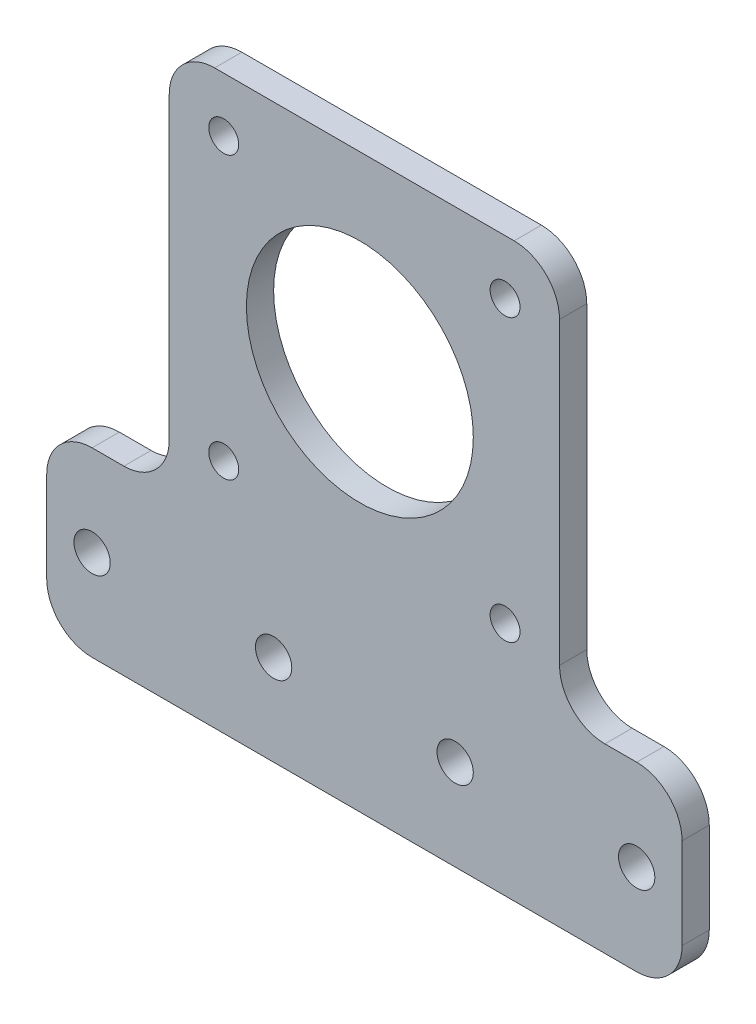
ISO-10303-21;
HEADER;
FILE_DESCRIPTION(('STEP AP214'),'2;1');
FILE_NAME('part.step','',(''),(''),'','','');
FILE_SCHEMA(('AUTOMOTIVE_DESIGN { 1 0 10303 214 1 1 1 1 }'));
ENDSEC;
DATA;
#1=APPLICATION_CONTEXT('core data for automotive mechanical design processes');
#2=APPLICATION_PROTOCOL_DEFINITION('international standard','automotive_design',2000,#1);
#3=PRODUCT_CONTEXT('',#1,'mechanical');
#4=PRODUCT('Part','Part','',(#3));
#5=PRODUCT_RELATED_PRODUCT_CATEGORY('part','',(#4));
#6=PRODUCT_DEFINITION_FORMATION('','',#4);
#7=PRODUCT_DEFINITION_CONTEXT('part definition',#1,'design');
#8=PRODUCT_DEFINITION('design','',#6,#7);
#9=PRODUCT_DEFINITION_SHAPE('','',#8);
#10=(LENGTH_UNIT() NAMED_UNIT(*) SI_UNIT(.MILLI.,.METRE.));
#11=(NAMED_UNIT(*) PLANE_ANGLE_UNIT() SI_UNIT($,.RADIAN.));
#12=(NAMED_UNIT(*) SI_UNIT($,.STERADIAN.) SOLID_ANGLE_UNIT());
#13=UNCERTAINTY_MEASURE_WITH_UNIT(LENGTH_MEASURE(1.E-05),#10,'distance_accuracy_value','');
#14=(GEOMETRIC_REPRESENTATION_CONTEXT(3) GLOBAL_UNCERTAINTY_ASSIGNED_CONTEXT((#13)) GLOBAL_UNIT_ASSIGNED_CONTEXT((#10,
#11,#12)) REPRESENTATION_CONTEXT('',''));
#15=CARTESIAN_POINT('',(0.,0.,0.));
#16=DIRECTION('',(0.,0.,1.));
#17=DIRECTION('',(1.,0.,0.));
#18=AXIS2_PLACEMENT_3D('',#15,#16,#17);
#19=CARTESIAN_POINT('',(56.5,0.,3.));
#20=DIRECTION('',(1.,0.,0.));
#21=DIRECTION('',(0.,1.,0.));
#22=AXIS2_PLACEMENT_3D('',#19,#20,#21);
#23=PLANE('',#22);
#24=DIRECTION('',(0.,-1.,0.));
#25=VECTOR('',#24,1.);
#26=CARTESIAN_POINT('',(56.5,0.,3.));
#27=LINE('',#26,#25);
#28=CARTESIAN_POINT('',(56.5,58.,3.));
#29=VERTEX_POINT('',#28);
#30=CARTESIAN_POINT('',(56.5,25.,3.));
#31=VERTEX_POINT('',#30);
#32=EDGE_CURVE('E318',#29,#31,#27,.T.);
#33=ORIENTED_EDGE('',*,*,#32,.T.);
#34=DIRECTION('',(0.,0.,-1.));
#35=VECTOR('',#34,1.);
#36=CARTESIAN_POINT('',(56.5,25.,0.));
#37=LINE('',#36,#35);
#38=CARTESIAN_POINT('',(56.5,25.,0.));
#39=VERTEX_POINT('',#38);
#40=EDGE_CURVE('E172',#31,#39,#37,.T.);
#41=ORIENTED_EDGE('',*,*,#40,.T.);
#42=DIRECTION('',(0.,-1.,0.));
#43=VECTOR('',#42,1.);
#44=CARTESIAN_POINT('',(56.5,0.,0.));
#45=LINE('',#44,#43);
#46=CARTESIAN_POINT('',(56.5,58.,0.));
#47=VERTEX_POINT('',#46);
#48=EDGE_CURVE('E156',#47,#39,#45,.T.);
#49=ORIENTED_EDGE('',*,*,#48,.F.);
#50=DIRECTION('',(0.,0.,-1.));
#51=VECTOR('',#50,1.);
#52=CARTESIAN_POINT('',(56.5,58.,3.));
#53=LINE('',#52,#51);
#54=EDGE_CURVE('E169',#47,#29,#53,.F.);
#55=ORIENTED_EDGE('',*,*,#54,.T.);
#56=EDGE_LOOP('',(#33,#41,#49,#55));
#57=FACE_BOUND('',#56,.T.);
#58=ADVANCED_FACE('F37',(#57),#23,.T.);
#59=CARTESIAN_POINT('',(0.,63.,3.));
#60=DIRECTION('',(0.,1.,0.));
#61=DIRECTION('',(0.,0.,1.));
#62=AXIS2_PLACEMENT_3D('',#59,#60,#61);
#63=PLANE('',#62);
#64=DIRECTION('',(1.,0.,0.));
#65=VECTOR('',#64,1.);
#66=CARTESIAN_POINT('',(0.,63.,3.));
#67=LINE('',#66,#65);
#68=CARTESIAN_POINT('',(18.5,63.,3.));
#69=VERTEX_POINT('',#68);
#70=CARTESIAN_POINT('',(51.5,63.,3.));
#71=VERTEX_POINT('',#70);
#72=EDGE_CURVE('E276',#69,#71,#67,.T.);
#73=ORIENTED_EDGE('',*,*,#72,.T.);
#74=DIRECTION('',(0.,0.,-1.));
#75=VECTOR('',#74,1.);
#76=CARTESIAN_POINT('',(51.5,63.,3.));
#77=LINE('',#76,#75);
#78=CARTESIAN_POINT('',(51.5,63.,0.));
#79=VERTEX_POINT('',#78);
#80=EDGE_CURVE('E237',#71,#79,#77,.T.);
#81=ORIENTED_EDGE('',*,*,#80,.T.);
#82=DIRECTION('',(1.,0.,0.));
#83=VECTOR('',#82,1.);
#84=CARTESIAN_POINT('',(0.,63.,0.));
#85=LINE('',#84,#83);
#86=CARTESIAN_POINT('',(18.5,63.,0.));
#87=VERTEX_POINT('',#86);
#88=EDGE_CURVE('E158',#87,#79,#85,.T.);
#89=ORIENTED_EDGE('',*,*,#88,.F.);
#90=DIRECTION('',(0.,0.,-1.));
#91=VECTOR('',#90,1.);
#92=CARTESIAN_POINT('',(18.5,63.,3.));
#93=LINE('',#92,#91);
#94=EDGE_CURVE('E235',#87,#69,#93,.F.);
#95=ORIENTED_EDGE('',*,*,#94,.T.);
#96=EDGE_LOOP('',(#73,#81,#89,#95));
#97=FACE_BOUND('',#96,.T.);
#98=ADVANCED_FACE('F399',(#97),#63,.T.);
#99=CARTESIAN_POINT('',(13.5,0.,3.));
#100=DIRECTION('',(1.,0.,0.));
#101=DIRECTION('',(0.,1.,0.));
#102=AXIS2_PLACEMENT_3D('',#99,#100,#101);
#103=PLANE('',#102);
#104=DIRECTION('',(0.,-1.,0.));
#105=VECTOR('',#104,1.);
#106=CARTESIAN_POINT('',(13.5,0.,0.));
#107=LINE('',#106,#105);
#108=CARTESIAN_POINT('',(13.5,58.,0.));
#109=VERTEX_POINT('',#108);
#110=CARTESIAN_POINT('',(13.5,25.,0.));
#111=VERTEX_POINT('',#110);
#112=EDGE_CURVE('E245',#109,#111,#107,.T.);
#113=ORIENTED_EDGE('',*,*,#112,.T.);
#114=DIRECTION('',(0.,0.,-1.));
#115=VECTOR('',#114,1.);
#116=CARTESIAN_POINT('',(13.5,25.,3.));
#117=LINE('',#116,#115);
#118=CARTESIAN_POINT('',(13.5,25.,3.));
#119=VERTEX_POINT('',#118);
#120=EDGE_CURVE('E233',#111,#119,#117,.F.);
#121=ORIENTED_EDGE('',*,*,#120,.T.);
#122=DIRECTION('',(0.,-1.,0.));
#123=VECTOR('',#122,1.);
#124=CARTESIAN_POINT('',(13.5,0.,3.));
#125=LINE('',#124,#123);
#126=CARTESIAN_POINT('',(13.5,58.,3.));
#127=VERTEX_POINT('',#126);
#128=EDGE_CURVE('E266',#127,#119,#125,.T.);
#129=ORIENTED_EDGE('',*,*,#128,.F.);
#130=DIRECTION('',(0.,0.,-1.));
#131=VECTOR('',#130,1.);
#132=CARTESIAN_POINT('',(13.5,58.,0.));
#133=LINE('',#132,#131);
#134=EDGE_CURVE('E230',#127,#109,#133,.T.);
#135=ORIENTED_EDGE('',*,*,#134,.T.);
#136=EDGE_LOOP('',(#113,#121,#129,#135));
#137=FACE_BOUND('',#136,.T.);
#138=ADVANCED_FACE('F252',(#137),#103,.F.);
#139=CARTESIAN_POINT('',(0.,20.,3.));
#140=DIRECTION('',(0.,1.,0.));
#141=DIRECTION('',(0.,0.,1.));
#142=AXIS2_PLACEMENT_3D('',#139,#140,#141);
#143=PLANE('',#142);
#144=DIRECTION('',(1.,0.,0.));
#145=VECTOR('',#144,1.);
#146=CARTESIAN_POINT('',(0.,20.,0.));
#147=LINE('',#146,#145);
#148=CARTESIAN_POINT('',(5.,20.,0.));
#149=VERTEX_POINT('',#148);
#150=CARTESIAN_POINT('',(8.5,20.,0.));
#151=VERTEX_POINT('',#150);
#152=EDGE_CURVE('E247',#149,#151,#147,.T.);
#153=ORIENTED_EDGE('',*,*,#152,.F.);
#154=DIRECTION('',(0.,0.,-1.));
#155=VECTOR('',#154,1.);
#156=CARTESIAN_POINT('',(5.,20.,3.));
#157=LINE('',#156,#155);
#158=CARTESIAN_POINT('',(5.,20.,3.));
#159=VERTEX_POINT('',#158);
#160=EDGE_CURVE('E228',#149,#159,#157,.F.);
#161=ORIENTED_EDGE('',*,*,#160,.T.);
#162=DIRECTION('',(1.,0.,0.));
#163=VECTOR('',#162,1.);
#164=CARTESIAN_POINT('',(0.,20.,3.));
#165=LINE('',#164,#163);
#166=CARTESIAN_POINT('',(8.5,20.,3.));
#167=VERTEX_POINT('',#166);
#168=EDGE_CURVE('E264',#159,#167,#165,.T.);
#169=ORIENTED_EDGE('',*,*,#168,.T.);
#170=DIRECTION('',(0.,0.,-1.));
#171=VECTOR('',#170,1.);
#172=CARTESIAN_POINT('',(8.5,20.,3.));
#173=LINE('',#172,#171);
#174=EDGE_CURVE('E225',#167,#151,#173,.T.);
#175=ORIENTED_EDGE('',*,*,#174,.T.);
#176=EDGE_LOOP('',(#153,#161,#169,#175));
#177=FACE_BOUND('',#176,.T.);
#178=ADVANCED_FACE('F268',(#177),#143,.T.);
#179=CARTESIAN_POINT('',(0.,0.,3.));
#180=DIRECTION('',(-1.,0.,0.));
#181=DIRECTION('',(0.,0.,1.));
#182=AXIS2_PLACEMENT_3D('',#179,#180,#181);
#183=PLANE('',#182);
#184=DIRECTION('',(0.,1.,0.));
#185=VECTOR('',#184,1.);
#186=CARTESIAN_POINT('',(0.,0.,0.));
#187=LINE('',#186,#185);
#188=CARTESIAN_POINT('',(0.,5.,0.));
#189=VERTEX_POINT('',#188);
#190=CARTESIAN_POINT('',(0.,15.,0.));
#191=VERTEX_POINT('',#190);
#192=EDGE_CURVE('E298',#189,#191,#187,.T.);
#193=ORIENTED_EDGE('',*,*,#192,.F.);
#194=DIRECTION('',(0.,0.,-1.));
#195=VECTOR('',#194,1.);
#196=CARTESIAN_POINT('',(0.,5.,3.));
#197=LINE('',#196,#195);
#198=CARTESIAN_POINT('',(0.,5.,3.));
#199=VERTEX_POINT('',#198);
#200=EDGE_CURVE('E223',#189,#199,#197,.F.);
#201=ORIENTED_EDGE('',*,*,#200,.T.);
#202=DIRECTION('',(0.,1.,0.));
#203=VECTOR('',#202,1.);
#204=CARTESIAN_POINT('',(0.,0.,3.));
#205=LINE('',#204,#203);
#206=CARTESIAN_POINT('',(0.,15.,3.));
#207=VERTEX_POINT('',#206);
#208=EDGE_CURVE('E270',#199,#207,#205,.T.);
#209=ORIENTED_EDGE('',*,*,#208,.T.);
#210=DIRECTION('',(0.,0.,-1.));
#211=VECTOR('',#210,1.);
#212=CARTESIAN_POINT('',(0.,15.,3.));
#213=LINE('',#212,#211);
#214=EDGE_CURVE('E220',#207,#191,#213,.T.);
#215=ORIENTED_EDGE('',*,*,#214,.T.);
#216=EDGE_LOOP('',(#193,#201,#209,#215));
#217=FACE_BOUND('',#216,.T.);
#218=ADVANCED_FACE('F535',(#217),#183,.T.);
#219=CARTESIAN_POINT('',(0.,0.,3.));
#220=DIRECTION('',(0.,1.,0.));
#221=DIRECTION('',(0.,0.,1.));
#222=AXIS2_PLACEMENT_3D('',#219,#220,#221);
#223=PLANE('',#222);
#224=DIRECTION('',(1.,0.,0.));
#225=VECTOR('',#224,1.);
#226=CARTESIAN_POINT('',(0.,0.,0.));
#227=LINE('',#226,#225);
#228=CARTESIAN_POINT('',(5.,0.,0.));
#229=VERTEX_POINT('',#228);
#230=CARTESIAN_POINT('',(65.,0.,0.));
#231=VERTEX_POINT('',#230);
#232=EDGE_CURVE('E302',#229,#231,#227,.T.);
#233=ORIENTED_EDGE('',*,*,#232,.T.);
#234=DIRECTION('',(0.,0.,-1.));
#235=VECTOR('',#234,1.);
#236=CARTESIAN_POINT('',(65.,0.,3.));
#237=LINE('',#236,#235);
#238=CARTESIAN_POINT('',(65.,0.,3.));
#239=VERTEX_POINT('',#238);
#240=EDGE_CURVE('E52',#231,#239,#237,.F.);
#241=ORIENTED_EDGE('',*,*,#240,.T.);
#242=DIRECTION('',(1.,0.,0.));
#243=VECTOR('',#242,1.);
#244=CARTESIAN_POINT('',(0.,0.,3.));
#245=LINE('',#244,#243);
#246=CARTESIAN_POINT('',(5.,0.,3.));
#247=VERTEX_POINT('',#246);
#248=EDGE_CURVE('E274',#247,#239,#245,.T.);
#249=ORIENTED_EDGE('',*,*,#248,.F.);
#250=DIRECTION('',(0.,0.,-1.));
#251=VECTOR('',#250,1.);
#252=CARTESIAN_POINT('',(5.,0.,0.));
#253=LINE('',#252,#251);
#254=EDGE_CURVE('E216',#247,#229,#253,.T.);
#255=ORIENTED_EDGE('',*,*,#254,.T.);
#256=EDGE_LOOP('',(#233,#241,#249,#255));
#257=FACE_BOUND('',#256,.T.);
#258=ADVANCED_FACE('F527',(#257),#223,.F.);
#259=CARTESIAN_POINT('',(70.,0.,3.));
#260=DIRECTION('',(-1.,0.,0.));
#261=DIRECTION('',(0.,0.,1.));
#262=AXIS2_PLACEMENT_3D('',#259,#260,#261);
#263=PLANE('',#262);
#264=DIRECTION('',(0.,1.,0.));
#265=VECTOR('',#264,1.);
#266=CARTESIAN_POINT('',(70.,0.,0.));
#267=LINE('',#266,#265);
#268=CARTESIAN_POINT('',(70.,5.,0.));
#269=VERTEX_POINT('',#268);
#270=CARTESIAN_POINT('',(70.,15.,0.));
#271=VERTEX_POINT('',#270);
#272=EDGE_CURVE('E304',#269,#271,#267,.T.);
#273=ORIENTED_EDGE('',*,*,#272,.T.);
#274=DIRECTION('',(0.,0.,-1.));
#275=VECTOR('',#274,1.);
#276=CARTESIAN_POINT('',(70.,15.,3.));
#277=LINE('',#276,#275);
#278=CARTESIAN_POINT('',(70.,15.,3.));
#279=VERTEX_POINT('',#278);
#280=EDGE_CURVE('E204',#271,#279,#277,.F.);
#281=ORIENTED_EDGE('',*,*,#280,.T.);
#282=DIRECTION('',(0.,1.,0.));
#283=VECTOR('',#282,1.);
#284=CARTESIAN_POINT('',(70.,0.,3.));
#285=LINE('',#284,#283);
#286=CARTESIAN_POINT('',(70.,5.,3.));
#287=VERTEX_POINT('',#286);
#288=EDGE_CURVE('E279',#287,#279,#285,.T.);
#289=ORIENTED_EDGE('',*,*,#288,.F.);
#290=DIRECTION('',(0.,0.,-1.));
#291=VECTOR('',#290,1.);
#292=CARTESIAN_POINT('',(70.,5.,3.));
#293=LINE('',#292,#291);
#294=EDGE_CURVE('E201',#287,#269,#293,.T.);
#295=ORIENTED_EDGE('',*,*,#294,.T.);
#296=EDGE_LOOP('',(#273,#281,#289,#295));
#297=FACE_BOUND('',#296,.T.);
#298=ADVANCED_FACE('F520',(#297),#263,.F.);
#299=CARTESIAN_POINT('',(50.5,26.,3.));
#300=DIRECTION('',(0.,0.,-1.));
#301=DIRECTION('',(-1.,0.,0.));
#302=AXIS2_PLACEMENT_3D('',#299,#300,#301);
#303=CYLINDRICAL_SURFACE('',#302,1.65);
#304=CARTESIAN_POINT('',(50.5,26.,3.));
#305=DIRECTION('',(0.,0.,1.));
#306=DIRECTION('',(1.,0.,0.));
#307=AXIS2_PLACEMENT_3D('',#304,#305,#306);
#308=CIRCLE('',#307,1.65);
#309=CARTESIAN_POINT('',(52.15,26.,3.));
#310=VERTEX_POINT('',#309);
#311=EDGE_CURVE('E183',#310,#310,#308,.T.);
#312=ORIENTED_EDGE('',*,*,#311,.T.);
#313=EDGE_LOOP('',(#312));
#314=FACE_BOUND('',#313,.T.);
#315=CARTESIAN_POINT('',(50.5,26.,0.));
#316=DIRECTION('',(0.,0.,1.));
#317=DIRECTION('',(1.,0.,0.));
#318=AXIS2_PLACEMENT_3D('',#315,#316,#317);
#319=CIRCLE('',#318,1.65);
#320=CARTESIAN_POINT('',(52.15,26.,0.));
#321=VERTEX_POINT('',#320);
#322=EDGE_CURVE('E306',#321,#321,#319,.T.);
#323=ORIENTED_EDGE('',*,*,#322,.F.);
#324=EDGE_LOOP('',(#323));
#325=FACE_BOUND('',#324,.T.);
#326=ADVANCED_FACE('F512',(#314,#325),#303,.F.);
#327=CARTESIAN_POINT('',(61.5,20.,0.));
#328=VERTEX_POINT('',#327);
#329=CARTESIAN_POINT('',(65.,20.,0.));
#330=VERTEX_POINT('',#329);
#331=EDGE_CURVE('E299',#328,#330,#147,.T.);
#332=ORIENTED_EDGE('',*,*,#331,.F.);
#333=DIRECTION('',(0.,0.,-1.));
#334=VECTOR('',#333,1.);
#335=CARTESIAN_POINT('',(61.5,20.,3.));
#336=LINE('',#335,#334);
#337=CARTESIAN_POINT('',(61.5,20.,3.));
#338=VERTEX_POINT('',#337);
#339=EDGE_CURVE('E191',#328,#338,#336,.F.);
#340=ORIENTED_EDGE('',*,*,#339,.T.);
#341=CARTESIAN_POINT('',(65.,20.,3.));
#342=VERTEX_POINT('',#341);
#343=EDGE_CURVE('E272',#338,#342,#165,.T.);
#344=ORIENTED_EDGE('',*,*,#343,.T.);
#345=DIRECTION('',(0.,0.,-1.));
#346=VECTOR('',#345,1.);
#347=CARTESIAN_POINT('',(65.,20.,0.));
#348=LINE('',#347,#346);
#349=EDGE_CURVE('E180',#342,#330,#348,.T.);
#350=ORIENTED_EDGE('',*,*,#349,.T.);
#351=EDGE_LOOP('',(#332,#340,#344,#350));
#352=FACE_BOUND('',#351,.T.);
#353=ADVANCED_FACE('F314',(#352),#143,.T.);
#354=CARTESIAN_POINT('',(19.5,57.,3.));
#355=DIRECTION('',(0.,0.,-1.));
#356=DIRECTION('',(-1.,0.,0.));
#357=AXIS2_PLACEMENT_3D('',#354,#355,#356);
#358=CYLINDRICAL_SURFACE('',#357,1.65);
#359=CARTESIAN_POINT('',(19.5,57.,3.));
#360=DIRECTION('',(0.,0.,1.));
#361=DIRECTION('',(1.,0.,0.));
#362=AXIS2_PLACEMENT_3D('',#359,#360,#361);
#363=CIRCLE('',#362,1.65);
#364=CARTESIAN_POINT('',(21.15,57.,3.));
#365=VERTEX_POINT('',#364);
#366=EDGE_CURVE('E319',#365,#365,#363,.T.);
#367=ORIENTED_EDGE('',*,*,#366,.T.);
#368=EDGE_LOOP('',(#367));
#369=FACE_BOUND('',#368,.T.);
#370=CARTESIAN_POINT('',(19.5,57.,0.));
#371=DIRECTION('',(0.,0.,1.));
#372=DIRECTION('',(1.,0.,0.));
#373=AXIS2_PLACEMENT_3D('',#370,#371,#372);
#374=CIRCLE('',#373,1.65);
#375=CARTESIAN_POINT('',(21.15,57.,0.));
#376=VERTEX_POINT('',#375);
#377=EDGE_CURVE('E173',#376,#376,#374,.T.);
#378=ORIENTED_EDGE('',*,*,#377,.F.);
#379=EDGE_LOOP('',(#378));
#380=FACE_BOUND('',#379,.T.);
#381=ADVANCED_FACE('F383',(#369,#380),#358,.F.);
#382=CARTESIAN_POINT('',(50.5,57.,3.));
#383=DIRECTION('',(0.,0.,-1.));
#384=DIRECTION('',(-1.,0.,0.));
#385=AXIS2_PLACEMENT_3D('',#382,#383,#384);
#386=CYLINDRICAL_SURFACE('',#385,1.65);
#387=CARTESIAN_POINT('',(50.5,57.,3.));
#388=DIRECTION('',(0.,0.,1.));
#389=DIRECTION('',(1.,0.,0.));
#390=AXIS2_PLACEMENT_3D('',#387,#388,#389);
#391=CIRCLE('',#390,1.65);
#392=CARTESIAN_POINT('',(52.15,57.,3.));
#393=VERTEX_POINT('',#392);
#394=EDGE_CURVE('E310',#393,#393,#391,.F.);
#395=ORIENTED_EDGE('',*,*,#394,.F.);
#396=EDGE_LOOP('',(#395));
#397=FACE_BOUND('',#396,.T.);
#398=CARTESIAN_POINT('',(50.5,57.,0.));
#399=DIRECTION('',(0.,0.,1.));
#400=DIRECTION('',(1.,0.,0.));
#401=AXIS2_PLACEMENT_3D('',#398,#399,#400);
#402=CIRCLE('',#401,1.65);
#403=CARTESIAN_POINT('',(52.15,57.,0.));
#404=VERTEX_POINT('',#403);
#405=EDGE_CURVE('E290',#404,#404,#402,.F.);
#406=ORIENTED_EDGE('',*,*,#405,.T.);
#407=EDGE_LOOP('',(#406));
#408=FACE_BOUND('',#407,.T.);
#409=ADVANCED_FACE('F386',(#397,#408),#386,.F.);
#410=CARTESIAN_POINT('',(19.5,26.,3.));
#411=DIRECTION('',(0.,0.,-1.));
#412=DIRECTION('',(-1.,0.,0.));
#413=AXIS2_PLACEMENT_3D('',#410,#411,#412);
#414=CYLINDRICAL_SURFACE('',#413,1.65);
#415=CARTESIAN_POINT('',(19.5,26.,3.));
#416=DIRECTION('',(0.,0.,1.));
#417=DIRECTION('',(1.,0.,0.));
#418=AXIS2_PLACEMENT_3D('',#415,#416,#417);
#419=CIRCLE('',#418,1.65);
#420=CARTESIAN_POINT('',(21.15,26.,3.));
#421=VERTEX_POINT('',#420);
#422=EDGE_CURVE('E178',#421,#421,#419,.F.);
#423=ORIENTED_EDGE('',*,*,#422,.F.);
#424=EDGE_LOOP('',(#423));
#425=FACE_BOUND('',#424,.T.);
#426=CARTESIAN_POINT('',(19.5,26.,0.));
#427=DIRECTION('',(0.,0.,1.));
#428=DIRECTION('',(1.,0.,0.));
#429=AXIS2_PLACEMENT_3D('',#426,#427,#428);
#430=CIRCLE('',#429,1.65);
#431=CARTESIAN_POINT('',(21.15,26.,0.));
#432=VERTEX_POINT('',#431);
#433=EDGE_CURVE('E186',#432,#432,#430,.F.);
#434=ORIENTED_EDGE('',*,*,#433,.T.);
#435=EDGE_LOOP('',(#434));
#436=FACE_BOUND('',#435,.T.);
#437=ADVANCED_FACE('F369',(#425,#436),#414,.F.);
#438=CARTESIAN_POINT('',(0.,0.,3.));
#439=DIRECTION('',(0.,0.,1.));
#440=DIRECTION('',(1.,0.,0.));
#441=AXIS2_PLACEMENT_3D('',#438,#439,#440);
#442=PLANE('',#441);
#443=CARTESIAN_POINT('',(34.5,42.,3.));
#444=DIRECTION('',(0.,0.,1.));
#445=DIRECTION('',(1.,0.,0.));
#446=AXIS2_PLACEMENT_3D('',#443,#444,#445);
#447=CIRCLE('',#446,12.5);
#448=CARTESIAN_POINT('',(47.,42.,3.));
#449=VERTEX_POINT('',#448);
#450=EDGE_CURVE('E352',#449,#449,#447,.T.);
#451=ORIENTED_EDGE('',*,*,#450,.F.);
#452=EDGE_LOOP('',(#451));
#453=FACE_BOUND('',#452,.T.);
#454=CARTESIAN_POINT('',(5.,10.,3.));
#455=DIRECTION('',(0.,0.,1.));
#456=DIRECTION('',(1.,0.,0.));
#457=AXIS2_PLACEMENT_3D('',#454,#455,#456);
#458=CIRCLE('',#457,2.);
#459=CARTESIAN_POINT('',(7.,10.,3.));
#460=VERTEX_POINT('',#459);
#461=EDGE_CURVE('E347',#460,#460,#458,.T.);
#462=ORIENTED_EDGE('',*,*,#461,.F.);
#463=EDGE_LOOP('',(#462));
#464=FACE_BOUND('',#463,.T.);
#465=CARTESIAN_POINT('',(25.,10.,3.));
#466=DIRECTION('',(0.,0.,1.));
#467=DIRECTION('',(1.,0.,0.));
#468=AXIS2_PLACEMENT_3D('',#465,#466,#467);
#469=CIRCLE('',#468,2.);
#470=CARTESIAN_POINT('',(27.,10.,3.));
#471=VERTEX_POINT('',#470);
#472=EDGE_CURVE('E341',#471,#471,#469,.T.);
#473=ORIENTED_EDGE('',*,*,#472,.F.);
#474=EDGE_LOOP('',(#473));
#475=FACE_BOUND('',#474,.T.);
#476=CARTESIAN_POINT('',(45.,10.,3.));
#477=DIRECTION('',(0.,0.,1.));
#478=DIRECTION('',(1.,0.,0.));
#479=AXIS2_PLACEMENT_3D('',#476,#477,#478);
#480=CIRCLE('',#479,2.);
#481=CARTESIAN_POINT('',(47.,10.,3.));
#482=VERTEX_POINT('',#481);
#483=EDGE_CURVE('E335',#482,#482,#480,.T.);
#484=ORIENTED_EDGE('',*,*,#483,.F.);
#485=EDGE_LOOP('',(#484));
#486=FACE_BOUND('',#485,.T.);
#487=CARTESIAN_POINT('',(65.,10.,3.));
#488=DIRECTION('',(0.,0.,1.));
#489=DIRECTION('',(1.,0.,0.));
#490=AXIS2_PLACEMENT_3D('',#487,#488,#489);
#491=CIRCLE('',#490,2.);
#492=CARTESIAN_POINT('',(67.,10.,3.));
#493=VERTEX_POINT('',#492);
#494=EDGE_CURVE('E328',#493,#493,#491,.T.);
#495=ORIENTED_EDGE('',*,*,#494,.F.);
#496=EDGE_LOOP('',(#495));
#497=FACE_BOUND('',#496,.T.);
#498=ORIENTED_EDGE('',*,*,#394,.T.);
#499=EDGE_LOOP('',(#498));
#500=FACE_BOUND('',#499,.T.);
#501=ORIENTED_EDGE('',*,*,#366,.F.);
#502=EDGE_LOOP('',(#501));
#503=FACE_BOUND('',#502,.T.);
#504=ORIENTED_EDGE('',*,*,#288,.T.);
#505=CARTESIAN_POINT('',(65.,15.,3.));
#506=DIRECTION('',(0.,0.,1.));
#507=DIRECTION('',(1.,0.,0.));
#508=AXIS2_PLACEMENT_3D('',#505,#506,#507);
#509=CIRCLE('',#508,5.);
#510=EDGE_CURVE('E214',#279,#342,#509,.T.);
#511=ORIENTED_EDGE('',*,*,#510,.T.);
#512=ORIENTED_EDGE('',*,*,#343,.F.);
#513=CARTESIAN_POINT('',(61.5,25.,3.));
#514=DIRECTION('',(0.,0.,1.));
#515=DIRECTION('',(1.,0.,0.));
#516=AXIS2_PLACEMENT_3D('',#513,#514,#515);
#517=CIRCLE('',#516,5.);
#518=EDGE_CURVE('E241',#338,#31,#517,.F.);
#519=ORIENTED_EDGE('',*,*,#518,.T.);
#520=ORIENTED_EDGE('',*,*,#32,.F.);
#521=CARTESIAN_POINT('',(51.5,58.,3.));
#522=DIRECTION('',(0.,0.,1.));
#523=DIRECTION('',(1.,0.,0.));
#524=AXIS2_PLACEMENT_3D('',#521,#522,#523);
#525=CIRCLE('',#524,5.);
#526=EDGE_CURVE('E177',#29,#71,#525,.T.);
#527=ORIENTED_EDGE('',*,*,#526,.T.);
#528=ORIENTED_EDGE('',*,*,#72,.F.);
#529=CARTESIAN_POINT('',(18.5,58.,3.));
#530=DIRECTION('',(0.,0.,1.));
#531=DIRECTION('',(1.,0.,0.));
#532=AXIS2_PLACEMENT_3D('',#529,#530,#531);
#533=CIRCLE('',#532,5.);
#534=EDGE_CURVE('E206',#69,#127,#533,.T.);
#535=ORIENTED_EDGE('',*,*,#534,.T.);
#536=ORIENTED_EDGE('',*,*,#128,.T.);
#537=CARTESIAN_POINT('',(8.5,25.,3.));
#538=DIRECTION('',(0.,0.,1.));
#539=DIRECTION('',(1.,0.,0.));
#540=AXIS2_PLACEMENT_3D('',#537,#538,#539);
#541=CIRCLE('',#540,5.);
#542=EDGE_CURVE('E11',#119,#167,#541,.F.);
#543=ORIENTED_EDGE('',*,*,#542,.T.);
#544=ORIENTED_EDGE('',*,*,#168,.F.);
#545=CARTESIAN_POINT('',(5.,15.,3.));
#546=DIRECTION('',(0.,0.,1.));
#547=DIRECTION('',(1.,0.,0.));
#548=AXIS2_PLACEMENT_3D('',#545,#546,#547);
#549=CIRCLE('',#548,5.);
#550=EDGE_CURVE('E209',#159,#207,#549,.T.);
#551=ORIENTED_EDGE('',*,*,#550,.T.);
#552=ORIENTED_EDGE('',*,*,#208,.F.);
#553=CARTESIAN_POINT('',(5.,5.,3.));
#554=DIRECTION('',(0.,0.,1.));
#555=DIRECTION('',(1.,0.,0.));
#556=AXIS2_PLACEMENT_3D('',#553,#554,#555);
#557=CIRCLE('',#556,5.);
#558=EDGE_CURVE('E59',#199,#247,#557,.T.);
#559=ORIENTED_EDGE('',*,*,#558,.T.);
#560=ORIENTED_EDGE('',*,*,#248,.T.);
#561=CARTESIAN_POINT('',(65.,5.,3.));
#562=DIRECTION('',(0.,0.,1.));
#563=DIRECTION('',(1.,0.,0.));
#564=AXIS2_PLACEMENT_3D('',#561,#562,#563);
#565=CIRCLE('',#564,5.);
#566=EDGE_CURVE('E212',#239,#287,#565,.T.);
#567=ORIENTED_EDGE('',*,*,#566,.T.);
#568=EDGE_LOOP('',(#504,#511,#512,#519,#520,#527,#528,#535,#536,#543,#544,#551,#552,#559,#560,#567));
#569=FACE_BOUND('',#568,.T.);
#570=ORIENTED_EDGE('',*,*,#311,.F.);
#571=EDGE_LOOP('',(#570));
#572=FACE_BOUND('',#571,.T.);
#573=ORIENTED_EDGE('',*,*,#422,.T.);
#574=EDGE_LOOP('',(#573));
#575=FACE_BOUND('',#574,.T.);
#576=ADVANCED_FACE('F262',(#453,#464,#475,#486,#497,#500,#503,#569,#572,#575),#442,.T.);
#577=CARTESIAN_POINT('',(0.,0.,0.));
#578=DIRECTION('',(0.,0.,1.));
#579=DIRECTION('',(1.,0.,0.));
#580=AXIS2_PLACEMENT_3D('',#577,#578,#579);
#581=PLANE('',#580);
#582=CARTESIAN_POINT('',(34.5,42.,0.));
#583=DIRECTION('',(0.,0.,1.));
#584=DIRECTION('',(1.,0.,0.));
#585=AXIS2_PLACEMENT_3D('',#582,#583,#584);
#586=CIRCLE('',#585,12.5);
#587=CARTESIAN_POINT('',(47.,42.,0.));
#588=VERTEX_POINT('',#587);
#589=EDGE_CURVE('E332',#588,#588,#586,.T.);
#590=ORIENTED_EDGE('',*,*,#589,.T.);
#591=EDGE_LOOP('',(#590));
#592=FACE_BOUND('',#591,.T.);
#593=CARTESIAN_POINT('',(5.,10.,0.));
#594=DIRECTION('',(0.,0.,1.));
#595=DIRECTION('',(1.,0.,0.));
#596=AXIS2_PLACEMENT_3D('',#593,#594,#595);
#597=CIRCLE('',#596,2.);
#598=CARTESIAN_POINT('',(7.,10.,0.));
#599=VERTEX_POINT('',#598);
#600=EDGE_CURVE('E293',#599,#599,#597,.T.);
#601=ORIENTED_EDGE('',*,*,#600,.T.);
#602=EDGE_LOOP('',(#601));
#603=FACE_BOUND('',#602,.T.);
#604=CARTESIAN_POINT('',(25.,10.,0.));
#605=DIRECTION('',(0.,0.,1.));
#606=DIRECTION('',(1.,0.,0.));
#607=AXIS2_PLACEMENT_3D('',#604,#605,#606);
#608=CIRCLE('',#607,2.);
#609=CARTESIAN_POINT('',(27.,10.,0.));
#610=VERTEX_POINT('',#609);
#611=EDGE_CURVE('E344',#610,#610,#608,.T.);
#612=ORIENTED_EDGE('',*,*,#611,.T.);
#613=EDGE_LOOP('',(#612));
#614=FACE_BOUND('',#613,.T.);
#615=CARTESIAN_POINT('',(45.,10.,0.));
#616=DIRECTION('',(0.,0.,1.));
#617=DIRECTION('',(1.,0.,0.));
#618=AXIS2_PLACEMENT_3D('',#615,#616,#617);
#619=CIRCLE('',#618,2.);
#620=CARTESIAN_POINT('',(47.,10.,0.));
#621=VERTEX_POINT('',#620);
#622=EDGE_CURVE('E338',#621,#621,#619,.T.);
#623=ORIENTED_EDGE('',*,*,#622,.T.);
#624=EDGE_LOOP('',(#623));
#625=FACE_BOUND('',#624,.T.);
#626=CARTESIAN_POINT('',(65.,10.,0.));
#627=DIRECTION('',(0.,0.,1.));
#628=DIRECTION('',(1.,0.,0.));
#629=AXIS2_PLACEMENT_3D('',#626,#627,#628);
#630=CIRCLE('',#629,2.);
#631=CARTESIAN_POINT('',(67.,10.,0.));
#632=VERTEX_POINT('',#631);
#633=EDGE_CURVE('E331',#632,#632,#630,.T.);
#634=ORIENTED_EDGE('',*,*,#633,.T.);
#635=EDGE_LOOP('',(#634));
#636=FACE_BOUND('',#635,.T.);
#637=ORIENTED_EDGE('',*,*,#405,.F.);
#638=EDGE_LOOP('',(#637));
#639=FACE_BOUND('',#638,.T.);
#640=ORIENTED_EDGE('',*,*,#377,.T.);
#641=EDGE_LOOP('',(#640));
#642=FACE_BOUND('',#641,.T.);
#643=ORIENTED_EDGE('',*,*,#331,.T.);
#644=CARTESIAN_POINT('',(65.,15.,0.));
#645=DIRECTION('',(0.,0.,1.));
#646=DIRECTION('',(1.,0.,0.));
#647=AXIS2_PLACEMENT_3D('',#644,#645,#646);
#648=CIRCLE('',#647,5.);
#649=EDGE_CURVE('E199',#330,#271,#648,.F.);
#650=ORIENTED_EDGE('',*,*,#649,.T.);
#651=ORIENTED_EDGE('',*,*,#272,.F.);
#652=CARTESIAN_POINT('',(65.,5.,0.));
#653=DIRECTION('',(0.,0.,1.));
#654=DIRECTION('',(1.,0.,0.));
#655=AXIS2_PLACEMENT_3D('',#652,#653,#654);
#656=CIRCLE('',#655,5.);
#657=EDGE_CURVE('E197',#269,#231,#656,.F.);
#658=ORIENTED_EDGE('',*,*,#657,.T.);
#659=ORIENTED_EDGE('',*,*,#232,.F.);
#660=CARTESIAN_POINT('',(5.,5.,0.));
#661=DIRECTION('',(0.,0.,1.));
#662=DIRECTION('',(1.,0.,0.));
#663=AXIS2_PLACEMENT_3D('',#660,#661,#662);
#664=CIRCLE('',#663,5.);
#665=EDGE_CURVE('E195',#229,#189,#664,.F.);
#666=ORIENTED_EDGE('',*,*,#665,.T.);
#667=ORIENTED_EDGE('',*,*,#192,.T.);
#668=CARTESIAN_POINT('',(5.,15.,0.));
#669=DIRECTION('',(0.,0.,1.));
#670=DIRECTION('',(1.,0.,0.));
#671=AXIS2_PLACEMENT_3D('',#668,#669,#670);
#672=CIRCLE('',#671,5.);
#673=EDGE_CURVE('E163',#191,#149,#672,.F.);
#674=ORIENTED_EDGE('',*,*,#673,.T.);
#675=ORIENTED_EDGE('',*,*,#152,.T.);
#676=CARTESIAN_POINT('',(8.5,25.,0.));
#677=DIRECTION('',(0.,0.,1.));
#678=DIRECTION('',(1.,0.,0.));
#679=AXIS2_PLACEMENT_3D('',#676,#677,#678);
#680=CIRCLE('',#679,5.);
#681=EDGE_CURVE('E45',#151,#111,#680,.T.);
#682=ORIENTED_EDGE('',*,*,#681,.T.);
#683=ORIENTED_EDGE('',*,*,#112,.F.);
#684=CARTESIAN_POINT('',(18.5,58.,0.));
#685=DIRECTION('',(0.,0.,1.));
#686=DIRECTION('',(1.,0.,0.));
#687=AXIS2_PLACEMENT_3D('',#684,#685,#686);
#688=CIRCLE('',#687,5.);
#689=EDGE_CURVE('E164',#109,#87,#688,.F.);
#690=ORIENTED_EDGE('',*,*,#689,.T.);
#691=ORIENTED_EDGE('',*,*,#88,.T.);
#692=CARTESIAN_POINT('',(51.5,58.,0.));
#693=DIRECTION('',(0.,0.,1.));
#694=DIRECTION('',(1.,0.,0.));
#695=AXIS2_PLACEMENT_3D('',#692,#693,#694);
#696=CIRCLE('',#695,5.);
#697=EDGE_CURVE('E151',#79,#47,#696,.F.);
#698=ORIENTED_EDGE('',*,*,#697,.T.);
#699=ORIENTED_EDGE('',*,*,#48,.T.);
#700=CARTESIAN_POINT('',(61.5,25.,0.));
#701=DIRECTION('',(0.,0.,1.));
#702=DIRECTION('',(1.,0.,0.));
#703=AXIS2_PLACEMENT_3D('',#700,#701,#702);
#704=CIRCLE('',#703,5.);
#705=EDGE_CURVE('E239',#39,#328,#704,.T.);
#706=ORIENTED_EDGE('',*,*,#705,.T.);
#707=EDGE_LOOP('',(#643,#650,#651,#658,#659,#666,#667,#674,#675,#682,#683,#690,#691,#698,#699,#706));
#708=FACE_BOUND('',#707,.T.);
#709=ORIENTED_EDGE('',*,*,#322,.T.);
#710=EDGE_LOOP('',(#709));
#711=FACE_BOUND('',#710,.T.);
#712=ORIENTED_EDGE('',*,*,#433,.F.);
#713=EDGE_LOOP('',(#712));
#714=FACE_BOUND('',#713,.T.);
#715=ADVANCED_FACE('F154',(#592,#603,#614,#625,#636,#639,#642,#708,#711,#714),#581,.F.);
#716=CARTESIAN_POINT('',(61.5,25.,3.));
#717=DIRECTION('',(0.,0.,1.));
#718=DIRECTION('',(1.,0.,0.));
#719=AXIS2_PLACEMENT_3D('',#716,#717,#718);
#720=CYLINDRICAL_SURFACE('',#719,5.);
#721=ORIENTED_EDGE('',*,*,#518,.F.);
#722=ORIENTED_EDGE('',*,*,#339,.F.);
#723=ORIENTED_EDGE('',*,*,#705,.F.);
#724=ORIENTED_EDGE('',*,*,#40,.F.);
#725=EDGE_LOOP('',(#721,#722,#723,#724));
#726=FACE_BOUND('',#725,.T.);
#727=ADVANCED_FACE('F317',(#726),#720,.F.);
#728=CARTESIAN_POINT('',(65.,15.,3.));
#729=DIRECTION('',(0.,0.,1.));
#730=DIRECTION('',(1.,0.,0.));
#731=AXIS2_PLACEMENT_3D('',#728,#729,#730);
#732=CYLINDRICAL_SURFACE('',#731,5.);
#733=ORIENTED_EDGE('',*,*,#510,.F.);
#734=ORIENTED_EDGE('',*,*,#280,.F.);
#735=ORIENTED_EDGE('',*,*,#649,.F.);
#736=ORIENTED_EDGE('',*,*,#349,.F.);
#737=EDGE_LOOP('',(#733,#734,#735,#736));
#738=FACE_BOUND('',#737,.T.);
#739=ADVANCED_FACE('F395',(#738),#732,.T.);
#740=CARTESIAN_POINT('',(65.,5.,3.));
#741=DIRECTION('',(0.,0.,-1.));
#742=DIRECTION('',(-1.,0.,0.));
#743=AXIS2_PLACEMENT_3D('',#740,#741,#742);
#744=CYLINDRICAL_SURFACE('',#743,5.);
#745=ORIENTED_EDGE('',*,*,#566,.F.);
#746=ORIENTED_EDGE('',*,*,#240,.F.);
#747=ORIENTED_EDGE('',*,*,#657,.F.);
#748=ORIENTED_EDGE('',*,*,#294,.F.);
#749=EDGE_LOOP('',(#745,#746,#747,#748));
#750=FACE_BOUND('',#749,.T.);
#751=ADVANCED_FACE('F413',(#750),#744,.T.);
#752=CARTESIAN_POINT('',(5.,5.,3.));
#753=DIRECTION('',(0.,0.,1.));
#754=DIRECTION('',(1.,0.,0.));
#755=AXIS2_PLACEMENT_3D('',#752,#753,#754);
#756=CYLINDRICAL_SURFACE('',#755,5.);
#757=ORIENTED_EDGE('',*,*,#558,.F.);
#758=ORIENTED_EDGE('',*,*,#200,.F.);
#759=ORIENTED_EDGE('',*,*,#665,.F.);
#760=ORIENTED_EDGE('',*,*,#254,.F.);
#761=EDGE_LOOP('',(#757,#758,#759,#760));
#762=FACE_BOUND('',#761,.T.);
#763=ADVANCED_FACE('F417',(#762),#756,.T.);
#764=CARTESIAN_POINT('',(5.,15.,3.));
#765=DIRECTION('',(0.,0.,-1.));
#766=DIRECTION('',(-1.,0.,0.));
#767=AXIS2_PLACEMENT_3D('',#764,#765,#766);
#768=CYLINDRICAL_SURFACE('',#767,5.);
#769=ORIENTED_EDGE('',*,*,#550,.F.);
#770=ORIENTED_EDGE('',*,*,#160,.F.);
#771=ORIENTED_EDGE('',*,*,#673,.F.);
#772=ORIENTED_EDGE('',*,*,#214,.F.);
#773=EDGE_LOOP('',(#769,#770,#771,#772));
#774=FACE_BOUND('',#773,.T.);
#775=ADVANCED_FACE('F421',(#774),#768,.T.);
#776=CARTESIAN_POINT('',(8.5,25.,3.));
#777=DIRECTION('',(0.,0.,-1.));
#778=DIRECTION('',(-1.,0.,0.));
#779=AXIS2_PLACEMENT_3D('',#776,#777,#778);
#780=CYLINDRICAL_SURFACE('',#779,5.);
#781=ORIENTED_EDGE('',*,*,#542,.F.);
#782=ORIENTED_EDGE('',*,*,#120,.F.);
#783=ORIENTED_EDGE('',*,*,#681,.F.);
#784=ORIENTED_EDGE('',*,*,#174,.F.);
#785=EDGE_LOOP('',(#781,#782,#783,#784));
#786=FACE_BOUND('',#785,.T.);
#787=ADVANCED_FACE('F258',(#786),#780,.F.);
#788=CARTESIAN_POINT('',(51.5,58.,3.));
#789=DIRECTION('',(0.,0.,-1.));
#790=DIRECTION('',(-1.,0.,0.));
#791=AXIS2_PLACEMENT_3D('',#788,#789,#790);
#792=CYLINDRICAL_SURFACE('',#791,5.);
#793=ORIENTED_EDGE('',*,*,#526,.F.);
#794=ORIENTED_EDGE('',*,*,#54,.F.);
#795=ORIENTED_EDGE('',*,*,#697,.F.);
#796=ORIENTED_EDGE('',*,*,#80,.F.);
#797=EDGE_LOOP('',(#793,#794,#795,#796));
#798=FACE_BOUND('',#797,.T.);
#799=ADVANCED_FACE('F176',(#798),#792,.T.);
#800=CARTESIAN_POINT('',(18.5,58.,3.));
#801=DIRECTION('',(0.,0.,1.));
#802=DIRECTION('',(1.,0.,0.));
#803=AXIS2_PLACEMENT_3D('',#800,#801,#802);
#804=CYLINDRICAL_SURFACE('',#803,5.);
#805=ORIENTED_EDGE('',*,*,#534,.F.);
#806=ORIENTED_EDGE('',*,*,#94,.F.);
#807=ORIENTED_EDGE('',*,*,#689,.F.);
#808=ORIENTED_EDGE('',*,*,#134,.F.);
#809=EDGE_LOOP('',(#805,#806,#807,#808));
#810=FACE_BOUND('',#809,.T.);
#811=ADVANCED_FACE('F39',(#810),#804,.T.);
#812=CARTESIAN_POINT('',(65.,10.,0.));
#813=DIRECTION('',(0.,0.,1.));
#814=DIRECTION('',(1.,0.,0.));
#815=AXIS2_PLACEMENT_3D('',#812,#813,#814);
#816=CYLINDRICAL_SURFACE('',#815,2.);
#817=ORIENTED_EDGE('',*,*,#633,.F.);
#818=EDGE_LOOP('',(#817));
#819=FACE_BOUND('',#818,.T.);
#820=ORIENTED_EDGE('',*,*,#494,.T.);
#821=EDGE_LOOP('',(#820));
#822=FACE_BOUND('',#821,.T.);
#823=ADVANCED_FACE('F431',(#819,#822),#816,.F.);
#824=CARTESIAN_POINT('',(45.,10.,0.));
#825=DIRECTION('',(0.,0.,1.));
#826=DIRECTION('',(1.,0.,0.));
#827=AXIS2_PLACEMENT_3D('',#824,#825,#826);
#828=CYLINDRICAL_SURFACE('',#827,2.);
#829=ORIENTED_EDGE('',*,*,#622,.F.);
#830=EDGE_LOOP('',(#829));
#831=FACE_BOUND('',#830,.T.);
#832=ORIENTED_EDGE('',*,*,#483,.T.);
#833=EDGE_LOOP('',(#832));
#834=FACE_BOUND('',#833,.T.);
#835=ADVANCED_FACE('F436',(#831,#834),#828,.F.);
#836=CARTESIAN_POINT('',(25.,10.,0.));
#837=DIRECTION('',(0.,0.,1.));
#838=DIRECTION('',(1.,0.,0.));
#839=AXIS2_PLACEMENT_3D('',#836,#837,#838);
#840=CYLINDRICAL_SURFACE('',#839,2.);
#841=ORIENTED_EDGE('',*,*,#611,.F.);
#842=EDGE_LOOP('',(#841));
#843=FACE_BOUND('',#842,.T.);
#844=ORIENTED_EDGE('',*,*,#472,.T.);
#845=EDGE_LOOP('',(#844));
#846=FACE_BOUND('',#845,.T.);
#847=ADVANCED_FACE('F445',(#843,#846),#840,.F.);
#848=CARTESIAN_POINT('',(5.,10.,0.));
#849=DIRECTION('',(0.,0.,1.));
#850=DIRECTION('',(1.,0.,0.));
#851=AXIS2_PLACEMENT_3D('',#848,#849,#850);
#852=CYLINDRICAL_SURFACE('',#851,2.);
#853=ORIENTED_EDGE('',*,*,#600,.F.);
#854=EDGE_LOOP('',(#853));
#855=FACE_BOUND('',#854,.T.);
#856=ORIENTED_EDGE('',*,*,#461,.T.);
#857=EDGE_LOOP('',(#856));
#858=FACE_BOUND('',#857,.T.);
#859=ADVANCED_FACE('F363',(#855,#858),#852,.F.);
#860=CARTESIAN_POINT('',(34.5,42.,0.));
#861=DIRECTION('',(0.,0.,1.));
#862=DIRECTION('',(1.,0.,0.));
#863=AXIS2_PLACEMENT_3D('',#860,#861,#862);
#864=CYLINDRICAL_SURFACE('',#863,12.5);
#865=ORIENTED_EDGE('',*,*,#589,.F.);
#866=EDGE_LOOP('',(#865));
#867=FACE_BOUND('',#866,.T.);
#868=ORIENTED_EDGE('',*,*,#450,.T.);
#869=EDGE_LOOP('',(#868));
#870=FACE_BOUND('',#869,.T.);
#871=ADVANCED_FACE('F360',(#867,#870),#864,.F.);
#872=CLOSED_SHELL('',(#58,#98,#138,#178,#218,#258,#298,#326,#353,#381,#409,#437,#576,#715,#727,
#739,#751,#763,#775,#787,#799,#811,#823,#835,#847,#859,#871));
#873=MANIFOLD_SOLID_BREP('B2',#872);
#874=ADVANCED_BREP_SHAPE_REPRESENTATION('',(#18,#873),#14);
#875=SHAPE_DEFINITION_REPRESENTATION(#9,#874);
ENDSEC;
END-ISO-10303-21;
